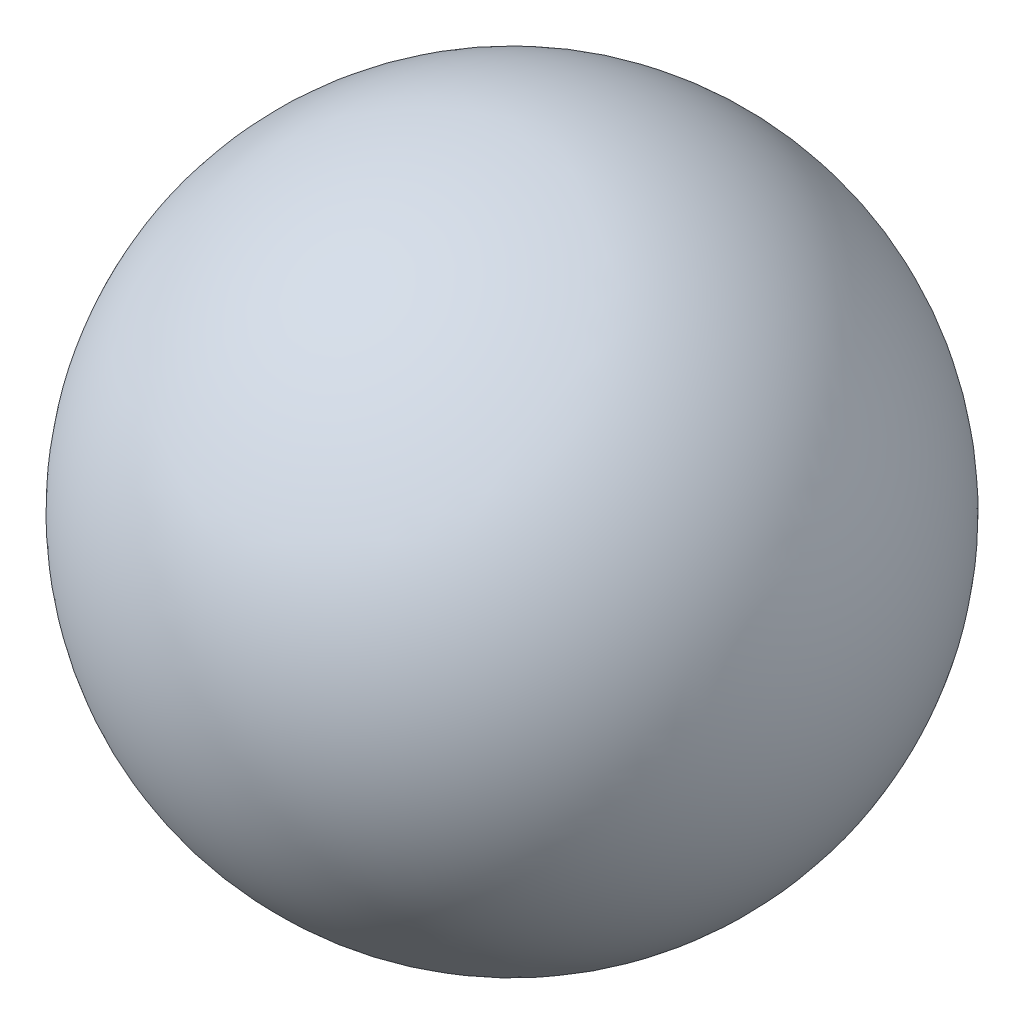
ISO-10303-21;
HEADER;
FILE_DESCRIPTION(('STEP AP214'),'2;1');
FILE_NAME('part.step','',(''),(''),'','','');
FILE_SCHEMA(('AUTOMOTIVE_DESIGN { 1 0 10303 214 1 1 1 1 }'));
ENDSEC;
DATA;
#1=APPLICATION_CONTEXT('core data for automotive mechanical design processes');
#2=APPLICATION_PROTOCOL_DEFINITION('international standard','automotive_design',2000,#1);
#3=PRODUCT_CONTEXT('',#1,'mechanical');
#4=PRODUCT('Part','Part','',(#3));
#5=PRODUCT_RELATED_PRODUCT_CATEGORY('part','',(#4));
#6=PRODUCT_DEFINITION_FORMATION('','',#4);
#7=PRODUCT_DEFINITION_CONTEXT('part definition',#1,'design');
#8=PRODUCT_DEFINITION('design','',#6,#7);
#9=PRODUCT_DEFINITION_SHAPE('','',#8);
#10=(LENGTH_UNIT() NAMED_UNIT(*) SI_UNIT(.MILLI.,.METRE.));
#11=(NAMED_UNIT(*) PLANE_ANGLE_UNIT() SI_UNIT($,.RADIAN.));
#12=(NAMED_UNIT(*) SI_UNIT($,.STERADIAN.) SOLID_ANGLE_UNIT());
#13=UNCERTAINTY_MEASURE_WITH_UNIT(LENGTH_MEASURE(1.E-05),#10,'distance_accuracy_value','');
#14=(GEOMETRIC_REPRESENTATION_CONTEXT(3) GLOBAL_UNCERTAINTY_ASSIGNED_CONTEXT((#13)) GLOBAL_UNIT_ASSIGNED_CONTEXT((#10,
#11,#12)) REPRESENTATION_CONTEXT('',''));
#15=CARTESIAN_POINT('',(0.,0.,0.));
#16=DIRECTION('',(0.,0.,1.));
#17=DIRECTION('',(1.,0.,0.));
#18=AXIS2_PLACEMENT_3D('',#15,#16,#17);
#19=CARTESIAN_POINT('',(0.,0.,0.));
#20=DIRECTION('',(-1.,0.,0.));
#21=DIRECTION('',(0.,0.,-1.));
#22=AXIS2_PLACEMENT_3D('',#19,#20,#21);
#23=SPHERICAL_SURFACE('',#22,63.5);
#24=CARTESIAN_POINT('',(-63.5,0.,0.));
#25=VERTEX_POINT('',#24);
#26=VERTEX_LOOP('',#25);
#27=FACE_BOUND('',#26,.T.);
#28=ADVANCED_FACE('F33',(#27),#23,.T.);
#29=CLOSED_SHELL('',(#28));
#30=MANIFOLD_SOLID_BREP('B2',#29);
#31=ADVANCED_BREP_SHAPE_REPRESENTATION('',(#18,#30),#14);
#32=SHAPE_DEFINITION_REPRESENTATION(#9,#31);
ENDSEC;
END-ISO-10303-21;
